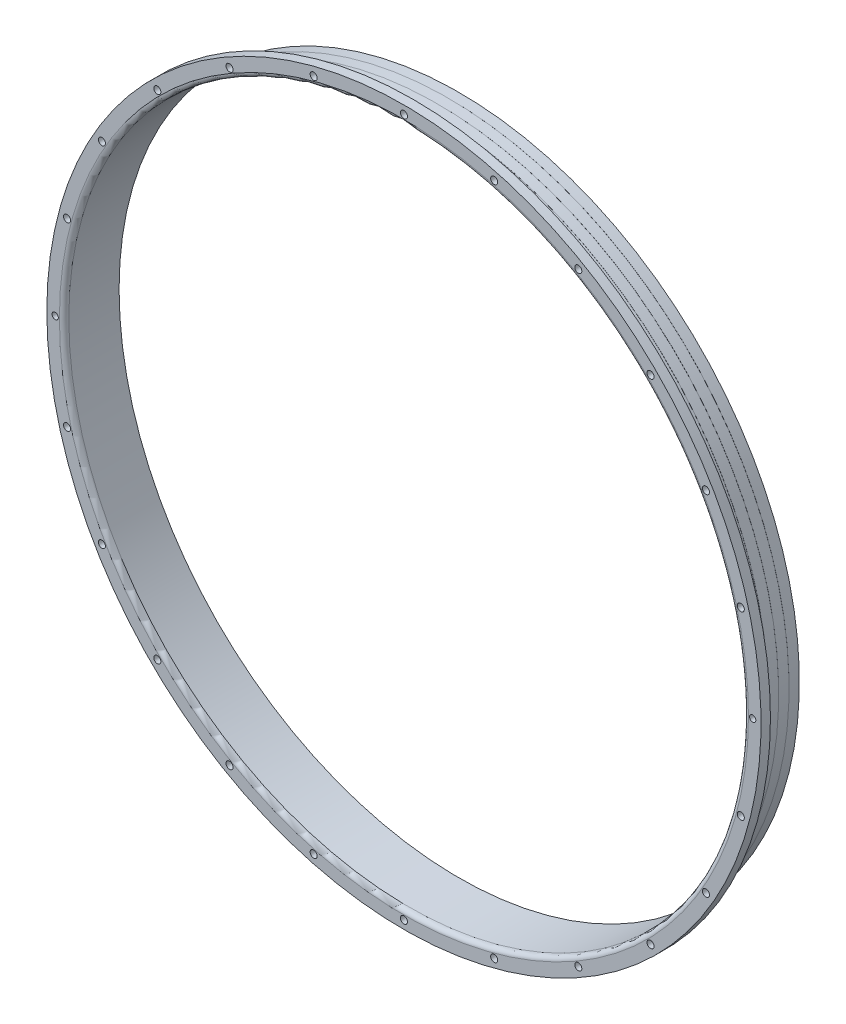
ISO-10303-21;
HEADER;
FILE_DESCRIPTION(('STEP AP214'),'2;1');
FILE_NAME('part.step','',(''),(''),'','','');
FILE_SCHEMA(('AUTOMOTIVE_DESIGN { 1 0 10303 214 1 1 1 1 }'));
ENDSEC;
DATA;
#1=APPLICATION_CONTEXT('core data for automotive mechanical design processes');
#2=APPLICATION_PROTOCOL_DEFINITION('international standard','automotive_design',2000,#1);
#3=PRODUCT_CONTEXT('',#1,'mechanical');
#4=PRODUCT('Part','Part','',(#3));
#5=PRODUCT_RELATED_PRODUCT_CATEGORY('part','',(#4));
#6=PRODUCT_DEFINITION_FORMATION('','',#4);
#7=PRODUCT_DEFINITION_CONTEXT('part definition',#1,'design');
#8=PRODUCT_DEFINITION('design','',#6,#7);
#9=PRODUCT_DEFINITION_SHAPE('','',#8);
#10=(LENGTH_UNIT() NAMED_UNIT(*) SI_UNIT(.MILLI.,.METRE.));
#11=(NAMED_UNIT(*) PLANE_ANGLE_UNIT() SI_UNIT($,.RADIAN.));
#12=(NAMED_UNIT(*) SI_UNIT($,.STERADIAN.) SOLID_ANGLE_UNIT());
#13=UNCERTAINTY_MEASURE_WITH_UNIT(LENGTH_MEASURE(1.E-05),#10,'distance_accuracy_value','');
#14=(GEOMETRIC_REPRESENTATION_CONTEXT(3) GLOBAL_UNCERTAINTY_ASSIGNED_CONTEXT((#13)) GLOBAL_UNIT_ASSIGNED_CONTEXT((#10,
#11,#12)) REPRESENTATION_CONTEXT('',''));
#15=CARTESIAN_POINT('',(0.,0.,0.));
#16=DIRECTION('',(0.,0.,1.));
#17=DIRECTION('',(1.,0.,0.));
#18=AXIS2_PLACEMENT_3D('',#15,#16,#17);
#19=CARTESIAN_POINT('',(0.,0.,0.));
#20=DIRECTION('',(0.,0.,-1.));
#21=DIRECTION('',(-1.,0.,0.));
#22=AXIS2_PLACEMENT_3D('',#19,#20,#21);
#23=CYLINDRICAL_SURFACE('',#22,217.39);
#24=CARTESIAN_POINT('',(0.,0.,-14.59025));
#25=DIRECTION('',(0.,0.,-1.));
#26=DIRECTION('',(-1.,0.,0.));
#27=AXIS2_PLACEMENT_3D('',#24,#25,#26);
#28=CIRCLE('',#27,217.39);
#29=CARTESIAN_POINT('',(-217.39,0.,-14.59025));
#30=VERTEX_POINT('',#29);
#31=EDGE_CURVE('E184',#30,#30,#28,.T.);
#32=ORIENTED_EDGE('',*,*,#31,.F.);
#33=EDGE_LOOP('',(#32));
#34=FACE_BOUND('',#33,.T.);
#35=CARTESIAN_POINT('',(0.,0.,-8.));
#36=DIRECTION('',(0.,0.,1.));
#37=DIRECTION('',(1.,0.,0.));
#38=AXIS2_PLACEMENT_3D('',#35,#36,#37);
#39=CIRCLE('',#38,217.39);
#40=CARTESIAN_POINT('',(217.39,0.,-8.));
#41=VERTEX_POINT('',#40);
#42=EDGE_CURVE('E42',#41,#41,#39,.F.);
#43=ORIENTED_EDGE('',*,*,#42,.T.);
#44=EDGE_LOOP('',(#43));
#45=FACE_BOUND('',#44,.T.);
#46=ADVANCED_FACE('F34',(#34,#45),#23,.T.);
#47=CARTESIAN_POINT('',(0.,0.,0.));
#48=DIRECTION('',(0.,0.,-1.));
#49=DIRECTION('',(-1.,0.,0.));
#50=AXIS2_PLACEMENT_3D('',#47,#48,#49);
#51=CYLINDRICAL_SURFACE('',#50,227.325);
#52=CARTESIAN_POINT('',(0.,0.,0.));
#53=DIRECTION('',(0.,0.,-1.));
#54=DIRECTION('',(-1.,0.,0.));
#55=AXIS2_PLACEMENT_3D('',#52,#53,#54);
#56=CIRCLE('',#55,227.325);
#57=CARTESIAN_POINT('',(-227.325,0.,0.));
#58=VERTEX_POINT('',#57);
#59=EDGE_CURVE('E208',#58,#58,#56,.T.);
#60=ORIENTED_EDGE('',*,*,#59,.T.);
#61=EDGE_LOOP('',(#60));
#62=FACE_BOUND('',#61,.T.);
#63=CARTESIAN_POINT('',(0.,0.,-6.));
#64=DIRECTION('',(0.,0.,1.));
#65=DIRECTION('',(1.,0.,0.));
#66=AXIS2_PLACEMENT_3D('',#63,#64,#65);
#67=CIRCLE('',#66,227.325);
#68=CARTESIAN_POINT('',(227.325,0.,-6.));
#69=VERTEX_POINT('',#68);
#70=EDGE_CURVE('E205',#69,#69,#67,.T.);
#71=ORIENTED_EDGE('',*,*,#70,.T.);
#72=EDGE_LOOP('',(#71));
#73=FACE_BOUND('',#72,.T.);
#74=ADVANCED_FACE('F223',(#62,#73),#51,.T.);
#75=CARTESIAN_POINT('',(0.,216.325,-35.));
#76=DIRECTION('',(0.,0.,-1.));
#77=DIRECTION('',(-1.,0.,0.));
#78=AXIS2_PLACEMENT_3D('',#75,#76,#77);
#79=PLANE('',#78);
#80=CARTESIAN_POINT('',(0.,0.,-35.));
#81=DIRECTION('',(0.,0.,-1.));
#82=DIRECTION('',(-1.,0.,0.));
#83=AXIS2_PLACEMENT_3D('',#80,#81,#82);
#84=CIRCLE('',#83,216.751);
#85=CARTESIAN_POINT('',(-216.751,0.,-35.));
#86=VERTEX_POINT('',#85);
#87=EDGE_CURVE('E202',#86,#86,#84,.T.);
#88=ORIENTED_EDGE('',*,*,#87,.T.);
#89=EDGE_LOOP('',(#88));
#90=FACE_BOUND('',#89,.T.);
#91=CARTESIAN_POINT('',(0.,0.,-35.));
#92=DIRECTION('',(0.,0.,-1.));
#93=DIRECTION('',(-1.,0.,0.));
#94=AXIS2_PLACEMENT_3D('',#91,#92,#93);
#95=CIRCLE('',#94,216.325);
#96=CARTESIAN_POINT('',(-216.325,0.,-35.));
#97=VERTEX_POINT('',#96);
#98=EDGE_CURVE('E47',#97,#97,#95,.T.);
#99=ORIENTED_EDGE('',*,*,#98,.F.);
#100=EDGE_LOOP('',(#99));
#101=FACE_BOUND('',#100,.T.);
#102=ADVANCED_FACE('F221',(#90,#101),#79,.T.);
#103=CARTESIAN_POINT('',(0.,0.,0.));
#104=DIRECTION('',(0.,0.,-1.));
#105=DIRECTION('',(-1.,0.,0.));
#106=AXIS2_PLACEMENT_3D('',#103,#104,#105);
#107=CYLINDRICAL_SURFACE('',#106,216.325);
#108=CARTESIAN_POINT('',(0.,0.,-3.));
#109=DIRECTION('',(0.,0.,-1.));
#110=DIRECTION('',(-1.,0.,0.));
#111=AXIS2_PLACEMENT_3D('',#108,#109,#110);
#112=CIRCLE('',#111,216.325);
#113=CARTESIAN_POINT('',(-216.325,0.,-3.));
#114=VERTEX_POINT('',#113);
#115=EDGE_CURVE('E214',#114,#114,#112,.T.);
#116=ORIENTED_EDGE('',*,*,#115,.F.);
#117=EDGE_LOOP('',(#116));
#118=FACE_BOUND('',#117,.T.);
#119=ORIENTED_EDGE('',*,*,#98,.T.);
#120=EDGE_LOOP('',(#119));
#121=FACE_BOUND('',#120,.T.);
#122=ADVANCED_FACE('F219',(#118,#121),#107,.F.);
#123=CARTESIAN_POINT('',(0.,0.,-3.));
#124=DIRECTION('',(0.,0.,-1.));
#125=DIRECTION('',(-1.,0.,0.));
#126=AXIS2_PLACEMENT_3D('',#123,#124,#125);
#127=TOROIDAL_SURFACE('',#126,219.325,3.);
#128=ORIENTED_EDGE('',*,*,#115,.T.);
#129=EDGE_LOOP('',(#128));
#130=FACE_BOUND('',#129,.T.);
#131=CARTESIAN_POINT('',(0.,0.,0.));
#132=DIRECTION('',(0.,0.,-1.));
#133=DIRECTION('',(-1.,0.,0.));
#134=AXIS2_PLACEMENT_3D('',#131,#132,#133);
#135=CIRCLE('',#134,219.325);
#136=CARTESIAN_POINT('',(-219.325,0.,0.));
#137=VERTEX_POINT('',#136);
#138=EDGE_CURVE('E211',#137,#137,#135,.T.);
#139=ORIENTED_EDGE('',*,*,#138,.F.);
#140=EDGE_LOOP('',(#139));
#141=FACE_BOUND('',#140,.T.);
#142=ADVANCED_FACE('F230',(#130,#141),#127,.T.);
#143=CARTESIAN_POINT('',(0.,227.325,0.));
#144=DIRECTION('',(0.,0.,1.));
#145=DIRECTION('',(1.,0.,0.));
#146=AXIS2_PLACEMENT_3D('',#143,#144,#145);
#147=PLANE('',#146);
#148=CARTESIAN_POINT('',(57.4578280127567,214.435533436174,0.));
#149=DIRECTION('',(0.,0.,1.));
#150=DIRECTION('',(1.,0.,0.));
#151=AXIS2_PLACEMENT_3D('',#148,#149,#150);
#152=CIRCLE('',#151,2.25);
#153=CARTESIAN_POINT('',(59.7078280127567,214.435533436174,0.));
#154=VERTEX_POINT('',#153);
#155=EDGE_CURVE('E106',#154,#154,#152,.T.);
#156=ORIENTED_EDGE('',*,*,#155,.F.);
#157=EDGE_LOOP('',(#156));
#158=FACE_BOUND('',#157,.T.);
#159=CARTESIAN_POINT('',(110.999999999998,192.257639640147,0.));
#160=DIRECTION('',(0.,0.,1.));
#161=DIRECTION('',(1.,0.,0.));
#162=AXIS2_PLACEMENT_3D('',#159,#160,#161);
#163=CIRCLE('',#162,2.25);
#164=CARTESIAN_POINT('',(113.249999999998,192.257639640147,0.));
#165=VERTEX_POINT('',#164);
#166=EDGE_CURVE('E96',#165,#165,#163,.T.);
#167=ORIENTED_EDGE('',*,*,#166,.F.);
#168=EDGE_LOOP('',(#167));
#169=FACE_BOUND('',#168,.T.);
#170=CARTESIAN_POINT('',(156.977705423412,156.977705423415,0.));
#171=DIRECTION('',(0.,0.,1.));
#172=DIRECTION('',(1.,0.,0.));
#173=AXIS2_PLACEMENT_3D('',#170,#171,#172);
#174=CIRCLE('',#173,2.25);
#175=CARTESIAN_POINT('',(159.227705423412,156.977705423415,0.));
#176=VERTEX_POINT('',#175);
#177=EDGE_CURVE('E93',#176,#176,#174,.T.);
#178=ORIENTED_EDGE('',*,*,#177,.F.);
#179=EDGE_LOOP('',(#178));
#180=FACE_BOUND('',#179,.T.);
#181=CARTESIAN_POINT('',(192.257639640144,111.000000000002,0.));
#182=DIRECTION('',(0.,0.,1.));
#183=DIRECTION('',(1.,0.,0.));
#184=AXIS2_PLACEMENT_3D('',#181,#182,#183);
#185=CIRCLE('',#184,2.25);
#186=CARTESIAN_POINT('',(194.507639640144,111.000000000002,0.));
#187=VERTEX_POINT('',#186);
#188=EDGE_CURVE('E90',#187,#187,#185,.T.);
#189=ORIENTED_EDGE('',*,*,#188,.F.);
#190=EDGE_LOOP('',(#189));
#191=FACE_BOUND('',#190,.T.);
#192=CARTESIAN_POINT('',(214.435533436173,57.457828012762,0.));
#193=DIRECTION('',(0.,0.,1.));
#194=DIRECTION('',(1.,0.,0.));
#195=AXIS2_PLACEMENT_3D('',#192,#193,#194);
#196=CIRCLE('',#195,2.25);
#197=CARTESIAN_POINT('',(216.685533436173,57.457828012762,0.));
#198=VERTEX_POINT('',#197);
#199=EDGE_CURVE('E86',#198,#198,#196,.T.);
#200=ORIENTED_EDGE('',*,*,#199,.F.);
#201=EDGE_LOOP('',(#200));
#202=FACE_BOUND('',#201,.T.);
#203=CARTESIAN_POINT('',(214.435533436174,-57.4578280127575,0.));
#204=DIRECTION('',(0.,0.,1.));
#205=DIRECTION('',(1.,0.,0.));
#206=AXIS2_PLACEMENT_3D('',#203,#204,#205);
#207=CIRCLE('',#206,2.25);
#208=CARTESIAN_POINT('',(216.685533436174,-57.4578280127575,0.));
#209=VERTEX_POINT('',#208);
#210=EDGE_CURVE('E82',#209,#209,#207,.T.);
#211=ORIENTED_EDGE('',*,*,#210,.F.);
#212=EDGE_LOOP('',(#211));
#213=FACE_BOUND('',#212,.T.);
#214=CARTESIAN_POINT('',(192.257639640146,-110.999999999998,0.));
#215=DIRECTION('',(0.,0.,1.));
#216=DIRECTION('',(1.,0.,0.));
#217=AXIS2_PLACEMENT_3D('',#214,#215,#216);
#218=CIRCLE('',#217,2.25);
#219=CARTESIAN_POINT('',(194.507639640146,-110.999999999998,0.));
#220=VERTEX_POINT('',#219);
#221=EDGE_CURVE('E81',#220,#220,#218,.T.);
#222=ORIENTED_EDGE('',*,*,#221,.F.);
#223=EDGE_LOOP('',(#222));
#224=FACE_BOUND('',#223,.T.);
#225=CARTESIAN_POINT('',(156.977705423415,-156.977705423412,0.));
#226=DIRECTION('',(0.,0.,1.));
#227=DIRECTION('',(1.,0.,0.));
#228=AXIS2_PLACEMENT_3D('',#225,#226,#227);
#229=CIRCLE('',#228,2.25);
#230=CARTESIAN_POINT('',(159.227705423415,-156.977705423412,0.));
#231=VERTEX_POINT('',#230);
#232=EDGE_CURVE('E121',#231,#231,#229,.T.);
#233=ORIENTED_EDGE('',*,*,#232,.F.);
#234=EDGE_LOOP('',(#233));
#235=FACE_BOUND('',#234,.T.);
#236=CARTESIAN_POINT('',(111.000000000002,-192.257639640144,0.));
#237=DIRECTION('',(0.,0.,1.));
#238=DIRECTION('',(1.,0.,0.));
#239=AXIS2_PLACEMENT_3D('',#236,#237,#238);
#240=CIRCLE('',#239,2.25);
#241=CARTESIAN_POINT('',(113.250000000002,-192.257639640144,0.));
#242=VERTEX_POINT('',#241);
#243=EDGE_CURVE('E127',#242,#242,#240,.T.);
#244=ORIENTED_EDGE('',*,*,#243,.F.);
#245=EDGE_LOOP('',(#244));
#246=FACE_BOUND('',#245,.T.);
#247=CARTESIAN_POINT('',(57.4578280127612,-214.435533436173,0.));
#248=DIRECTION('',(0.,0.,1.));
#249=DIRECTION('',(1.,0.,0.));
#250=AXIS2_PLACEMENT_3D('',#247,#248,#249);
#251=CIRCLE('',#250,2.25);
#252=CARTESIAN_POINT('',(59.7078280127612,-214.435533436173,0.));
#253=VERTEX_POINT('',#252);
#254=EDGE_CURVE('E77',#253,#253,#251,.T.);
#255=ORIENTED_EDGE('',*,*,#254,.F.);
#256=EDGE_LOOP('',(#255));
#257=FACE_BOUND('',#256,.T.);
#258=CARTESIAN_POINT('',(0.,-222.,0.));
#259=DIRECTION('',(0.,0.,1.));
#260=DIRECTION('',(1.,0.,0.));
#261=AXIS2_PLACEMENT_3D('',#258,#259,#260);
#262=CIRCLE('',#261,2.25);
#263=CARTESIAN_POINT('',(2.25,-222.,0.));
#264=VERTEX_POINT('',#263);
#265=EDGE_CURVE('E76',#264,#264,#262,.T.);
#266=ORIENTED_EDGE('',*,*,#265,.F.);
#267=EDGE_LOOP('',(#266));
#268=FACE_BOUND('',#267,.T.);
#269=CARTESIAN_POINT('',(-57.4578280127582,-214.435533436174,0.));
#270=DIRECTION('',(0.,0.,1.));
#271=DIRECTION('',(1.,0.,0.));
#272=AXIS2_PLACEMENT_3D('',#269,#270,#271);
#273=CIRCLE('',#272,2.25);
#274=CARTESIAN_POINT('',(-55.2078280127582,-214.435533436174,0.));
#275=VERTEX_POINT('',#274);
#276=EDGE_CURVE('E140',#275,#275,#273,.T.);
#277=ORIENTED_EDGE('',*,*,#276,.F.);
#278=EDGE_LOOP('',(#277));
#279=FACE_BOUND('',#278,.T.);
#280=CARTESIAN_POINT('',(-110.999999999999,-192.257639640146,0.));
#281=DIRECTION('',(0.,0.,1.));
#282=DIRECTION('',(1.,0.,0.));
#283=AXIS2_PLACEMENT_3D('',#280,#281,#282);
#284=CIRCLE('',#283,2.25);
#285=CARTESIAN_POINT('',(-108.749999999999,-192.257639640146,0.));
#286=VERTEX_POINT('',#285);
#287=EDGE_CURVE('E146',#286,#286,#284,.T.);
#288=ORIENTED_EDGE('',*,*,#287,.F.);
#289=EDGE_LOOP('',(#288));
#290=FACE_BOUND('',#289,.T.);
#291=CARTESIAN_POINT('',(-156.977705423413,-156.977705423414,0.));
#292=DIRECTION('',(0.,0.,1.));
#293=DIRECTION('',(1.,0.,0.));
#294=AXIS2_PLACEMENT_3D('',#291,#292,#293);
#295=CIRCLE('',#294,2.25);
#296=CARTESIAN_POINT('',(-154.727705423413,-156.977705423414,0.));
#297=VERTEX_POINT('',#296);
#298=EDGE_CURVE('E152',#297,#297,#295,.T.);
#299=ORIENTED_EDGE('',*,*,#298,.F.);
#300=EDGE_LOOP('',(#299));
#301=FACE_BOUND('',#300,.T.);
#302=CARTESIAN_POINT('',(-192.257639640145,-111.000000000001,0.));
#303=DIRECTION('',(0.,0.,1.));
#304=DIRECTION('',(1.,0.,0.));
#305=AXIS2_PLACEMENT_3D('',#302,#303,#304);
#306=CIRCLE('',#305,2.25);
#307=CARTESIAN_POINT('',(-190.007639640145,-111.000000000001,0.));
#308=VERTEX_POINT('',#307);
#309=EDGE_CURVE('E158',#308,#308,#306,.T.);
#310=ORIENTED_EDGE('',*,*,#309,.F.);
#311=EDGE_LOOP('',(#310));
#312=FACE_BOUND('',#311,.T.);
#313=CARTESIAN_POINT('',(-214.435533436173,-57.4578280127605,0.));
#314=DIRECTION('',(0.,0.,1.));
#315=DIRECTION('',(1.,0.,0.));
#316=AXIS2_PLACEMENT_3D('',#313,#314,#315);
#317=CIRCLE('',#316,2.25);
#318=CARTESIAN_POINT('',(-212.185533436173,-57.4578280127605,0.));
#319=VERTEX_POINT('',#318);
#320=EDGE_CURVE('E72',#319,#319,#317,.T.);
#321=ORIENTED_EDGE('',*,*,#320,.F.);
#322=EDGE_LOOP('',(#321));
#323=FACE_BOUND('',#322,.T.);
#324=CARTESIAN_POINT('',(-214.435533436173,57.457828012759,0.));
#325=DIRECTION('',(0.,0.,1.));
#326=DIRECTION('',(1.,0.,0.));
#327=AXIS2_PLACEMENT_3D('',#324,#325,#326);
#328=CIRCLE('',#327,2.25);
#329=CARTESIAN_POINT('',(-212.185533436173,57.457828012759,0.));
#330=VERTEX_POINT('',#329);
#331=EDGE_CURVE('E68',#330,#330,#328,.T.);
#332=ORIENTED_EDGE('',*,*,#331,.F.);
#333=EDGE_LOOP('',(#332));
#334=FACE_BOUND('',#333,.T.);
#335=CARTESIAN_POINT('',(-192.257639640146,111.,0.));
#336=DIRECTION('',(0.,0.,1.));
#337=DIRECTION('',(1.,0.,0.));
#338=AXIS2_PLACEMENT_3D('',#335,#336,#337);
#339=CIRCLE('',#338,2.25);
#340=CARTESIAN_POINT('',(-190.007639640146,111.,0.));
#341=VERTEX_POINT('',#340);
#342=EDGE_CURVE('E64',#341,#341,#339,.T.);
#343=ORIENTED_EDGE('',*,*,#342,.F.);
#344=EDGE_LOOP('',(#343));
#345=FACE_BOUND('',#344,.T.);
#346=CARTESIAN_POINT('',(-156.977705423414,156.977705423413,0.));
#347=DIRECTION('',(0.,0.,1.));
#348=DIRECTION('',(1.,0.,0.));
#349=AXIS2_PLACEMENT_3D('',#346,#347,#348);
#350=CIRCLE('',#349,2.25);
#351=CARTESIAN_POINT('',(-154.727705423414,156.977705423413,0.));
#352=VERTEX_POINT('',#351);
#353=EDGE_CURVE('E60',#352,#352,#350,.T.);
#354=ORIENTED_EDGE('',*,*,#353,.F.);
#355=EDGE_LOOP('',(#354));
#356=FACE_BOUND('',#355,.T.);
#357=CARTESIAN_POINT('',(-111.,192.257639640145,0.));
#358=DIRECTION('',(0.,0.,1.));
#359=DIRECTION('',(1.,0.,0.));
#360=AXIS2_PLACEMENT_3D('',#357,#358,#359);
#361=CIRCLE('',#360,2.25);
#362=CARTESIAN_POINT('',(-108.75,192.257639640145,0.));
#363=VERTEX_POINT('',#362);
#364=EDGE_CURVE('E59',#363,#363,#361,.T.);
#365=ORIENTED_EDGE('',*,*,#364,.F.);
#366=EDGE_LOOP('',(#365));
#367=FACE_BOUND('',#366,.T.);
#368=CARTESIAN_POINT('',(-57.4578280127597,214.435533436173,0.));
#369=DIRECTION('',(0.,0.,1.));
#370=DIRECTION('',(1.,0.,0.));
#371=AXIS2_PLACEMENT_3D('',#368,#369,#370);
#372=CIRCLE('',#371,2.25);
#373=CARTESIAN_POINT('',(-55.2078280127597,214.435533436173,0.));
#374=VERTEX_POINT('',#373);
#375=EDGE_CURVE('E55',#374,#374,#372,.T.);
#376=ORIENTED_EDGE('',*,*,#375,.F.);
#377=EDGE_LOOP('',(#376));
#378=FACE_BOUND('',#377,.T.);
#379=CARTESIAN_POINT('',(0.,222.,0.));
#380=DIRECTION('',(0.,0.,1.));
#381=DIRECTION('',(1.,0.,0.));
#382=AXIS2_PLACEMENT_3D('',#379,#380,#381);
#383=CIRCLE('',#382,2.25);
#384=CARTESIAN_POINT('',(2.25,222.,0.));
#385=VERTEX_POINT('',#384);
#386=EDGE_CURVE('E54',#385,#385,#383,.T.);
#387=ORIENTED_EDGE('',*,*,#386,.F.);
#388=EDGE_LOOP('',(#387));
#389=FACE_BOUND('',#388,.T.);
#390=ORIENTED_EDGE('',*,*,#138,.T.);
#391=EDGE_LOOP('',(#390));
#392=FACE_BOUND('',#391,.T.);
#393=ORIENTED_EDGE('',*,*,#59,.F.);
#394=EDGE_LOOP('',(#393));
#395=FACE_BOUND('',#394,.T.);
#396=CARTESIAN_POINT('',(-222.,-7.74891763399207E-13,0.));
#397=DIRECTION('',(0.,0.,1.));
#398=DIRECTION('',(1.,0.,0.));
#399=AXIS2_PLACEMENT_3D('',#396,#397,#398);
#400=CIRCLE('',#399,2.);
#401=CARTESIAN_POINT('',(-220.,-7.74891763399207E-13,0.));
#402=VERTEX_POINT('',#401);
#403=EDGE_CURVE('E278',#402,#402,#400,.T.);
#404=ORIENTED_EDGE('',*,*,#403,.F.);
#405=EDGE_LOOP('',(#404));
#406=FACE_BOUND('',#405,.T.);
#407=CARTESIAN_POINT('',(222.,2.32510947784556E-12,0.));
#408=DIRECTION('',(0.,0.,1.));
#409=DIRECTION('',(1.,0.,0.));
#410=AXIS2_PLACEMENT_3D('',#407,#408,#409);
#411=CIRCLE('',#410,2.);
#412=CARTESIAN_POINT('',(224.,2.32510947784556E-12,0.));
#413=VERTEX_POINT('',#412);
#414=EDGE_CURVE('E281',#413,#413,#411,.T.);
#415=ORIENTED_EDGE('',*,*,#414,.F.);
#416=EDGE_LOOP('',(#415));
#417=FACE_BOUND('',#416,.T.);
#418=ADVANCED_FACE('F254',(#158,#169,#180,#191,#202,#213,#224,#235,#246,#257,#268,#279,#290,
#301,#312,#323,#334,#345,#356,#367,#378,#389,#392,#395,#406,#417),#147,.T.);
#419=CARTESIAN_POINT('',(0.,227.325,-6.));
#420=DIRECTION('',(0.,0.,1.));
#421=DIRECTION('',(1.,0.,0.));
#422=AXIS2_PLACEMENT_3D('',#419,#420,#421);
#423=PLANE('',#422);
#424=CARTESIAN_POINT('',(57.4578280127567,214.435533436174,-6.));
#425=DIRECTION('',(0.,0.,1.));
#426=DIRECTION('',(1.,0.,0.));
#427=AXIS2_PLACEMENT_3D('',#424,#425,#426);
#428=CIRCLE('',#427,2.25);
#429=CARTESIAN_POINT('',(59.7078280127567,214.435533436174,-6.));
#430=VERTEX_POINT('',#429);
#431=EDGE_CURVE('E38',#430,#430,#428,.T.);
#432=ORIENTED_EDGE('',*,*,#431,.T.);
#433=EDGE_LOOP('',(#432));
#434=FACE_BOUND('',#433,.T.);
#435=CARTESIAN_POINT('',(110.999999999998,192.257639640147,-6.));
#436=DIRECTION('',(0.,0.,1.));
#437=DIRECTION('',(1.,0.,0.));
#438=AXIS2_PLACEMENT_3D('',#435,#436,#437);
#439=CIRCLE('',#438,2.25);
#440=CARTESIAN_POINT('',(113.249999999998,192.257639640147,-6.));
#441=VERTEX_POINT('',#440);
#442=EDGE_CURVE('E94',#441,#441,#439,.T.);
#443=ORIENTED_EDGE('',*,*,#442,.T.);
#444=EDGE_LOOP('',(#443));
#445=FACE_BOUND('',#444,.T.);
#446=CARTESIAN_POINT('',(156.977705423412,156.977705423415,-6.));
#447=DIRECTION('',(0.,0.,1.));
#448=DIRECTION('',(1.,0.,0.));
#449=AXIS2_PLACEMENT_3D('',#446,#447,#448);
#450=CIRCLE('',#449,2.25);
#451=CARTESIAN_POINT('',(159.227705423412,156.977705423415,-6.));
#452=VERTEX_POINT('',#451);
#453=EDGE_CURVE('E91',#452,#452,#450,.T.);
#454=ORIENTED_EDGE('',*,*,#453,.T.);
#455=EDGE_LOOP('',(#454));
#456=FACE_BOUND('',#455,.T.);
#457=CARTESIAN_POINT('',(192.257639640144,111.000000000002,-6.));
#458=DIRECTION('',(0.,0.,1.));
#459=DIRECTION('',(1.,0.,0.));
#460=AXIS2_PLACEMENT_3D('',#457,#458,#459);
#461=CIRCLE('',#460,2.25);
#462=CARTESIAN_POINT('',(194.507639640144,111.000000000002,-6.));
#463=VERTEX_POINT('',#462);
#464=EDGE_CURVE('E87',#463,#463,#461,.T.);
#465=ORIENTED_EDGE('',*,*,#464,.T.);
#466=EDGE_LOOP('',(#465));
#467=FACE_BOUND('',#466,.T.);
#468=CARTESIAN_POINT('',(214.435533436173,57.457828012762,-6.));
#469=DIRECTION('',(0.,0.,1.));
#470=DIRECTION('',(1.,0.,0.));
#471=AXIS2_PLACEMENT_3D('',#468,#469,#470);
#472=CIRCLE('',#471,2.25);
#473=CARTESIAN_POINT('',(216.685533436173,57.457828012762,-6.));
#474=VERTEX_POINT('',#473);
#475=EDGE_CURVE('E83',#474,#474,#472,.T.);
#476=ORIENTED_EDGE('',*,*,#475,.T.);
#477=EDGE_LOOP('',(#476));
#478=FACE_BOUND('',#477,.T.);
#479=CARTESIAN_POINT('',(214.435533436174,-57.4578280127575,-6.));
#480=DIRECTION('',(0.,0.,1.));
#481=DIRECTION('',(1.,0.,0.));
#482=AXIS2_PLACEMENT_3D('',#479,#480,#481);
#483=CIRCLE('',#482,2.25);
#484=CARTESIAN_POINT('',(216.685533436174,-57.4578280127575,-6.));
#485=VERTEX_POINT('',#484);
#486=EDGE_CURVE('E78',#485,#485,#483,.T.);
#487=ORIENTED_EDGE('',*,*,#486,.T.);
#488=EDGE_LOOP('',(#487));
#489=FACE_BOUND('',#488,.T.);
#490=CARTESIAN_POINT('',(192.257639640146,-110.999999999998,-6.));
#491=DIRECTION('',(0.,0.,1.));
#492=DIRECTION('',(1.,0.,0.));
#493=AXIS2_PLACEMENT_3D('',#490,#491,#492);
#494=CIRCLE('',#493,2.25);
#495=CARTESIAN_POINT('',(194.507639640146,-110.999999999998,-6.));
#496=VERTEX_POINT('',#495);
#497=EDGE_CURVE('E118',#496,#496,#494,.T.);
#498=ORIENTED_EDGE('',*,*,#497,.T.);
#499=EDGE_LOOP('',(#498));
#500=FACE_BOUND('',#499,.T.);
#501=CARTESIAN_POINT('',(156.977705423415,-156.977705423412,-6.));
#502=DIRECTION('',(0.,0.,1.));
#503=DIRECTION('',(1.,0.,0.));
#504=AXIS2_PLACEMENT_3D('',#501,#502,#503);
#505=CIRCLE('',#504,2.25);
#506=CARTESIAN_POINT('',(159.227705423415,-156.977705423412,-6.));
#507=VERTEX_POINT('',#506);
#508=EDGE_CURVE('E124',#507,#507,#505,.T.);
#509=ORIENTED_EDGE('',*,*,#508,.T.);
#510=EDGE_LOOP('',(#509));
#511=FACE_BOUND('',#510,.T.);
#512=CARTESIAN_POINT('',(111.000000000002,-192.257639640144,-6.));
#513=DIRECTION('',(0.,0.,1.));
#514=DIRECTION('',(1.,0.,0.));
#515=AXIS2_PLACEMENT_3D('',#512,#513,#514);
#516=CIRCLE('',#515,2.25);
#517=CARTESIAN_POINT('',(113.250000000002,-192.257639640144,-6.));
#518=VERTEX_POINT('',#517);
#519=EDGE_CURVE('E130',#518,#518,#516,.T.);
#520=ORIENTED_EDGE('',*,*,#519,.T.);
#521=EDGE_LOOP('',(#520));
#522=FACE_BOUND('',#521,.T.);
#523=CARTESIAN_POINT('',(57.4578280127612,-214.435533436173,-6.));
#524=DIRECTION('',(0.,0.,1.));
#525=DIRECTION('',(1.,0.,0.));
#526=AXIS2_PLACEMENT_3D('',#523,#524,#525);
#527=CIRCLE('',#526,2.25);
#528=CARTESIAN_POINT('',(59.7078280127612,-214.435533436173,-6.));
#529=VERTEX_POINT('',#528);
#530=EDGE_CURVE('E73',#529,#529,#527,.T.);
#531=ORIENTED_EDGE('',*,*,#530,.T.);
#532=EDGE_LOOP('',(#531));
#533=FACE_BOUND('',#532,.T.);
#534=CARTESIAN_POINT('',(0.,-222.,-6.));
#535=DIRECTION('',(0.,0.,1.));
#536=DIRECTION('',(1.,0.,0.));
#537=AXIS2_PLACEMENT_3D('',#534,#535,#536);
#538=CIRCLE('',#537,2.25);
#539=CARTESIAN_POINT('',(2.25,-222.,-6.));
#540=VERTEX_POINT('',#539);
#541=EDGE_CURVE('E137',#540,#540,#538,.T.);
#542=ORIENTED_EDGE('',*,*,#541,.T.);
#543=EDGE_LOOP('',(#542));
#544=FACE_BOUND('',#543,.T.);
#545=CARTESIAN_POINT('',(-57.4578280127582,-214.435533436174,-6.));
#546=DIRECTION('',(0.,0.,1.));
#547=DIRECTION('',(1.,0.,0.));
#548=AXIS2_PLACEMENT_3D('',#545,#546,#547);
#549=CIRCLE('',#548,2.25);
#550=CARTESIAN_POINT('',(-55.2078280127582,-214.435533436174,-6.));
#551=VERTEX_POINT('',#550);
#552=EDGE_CURVE('E143',#551,#551,#549,.T.);
#553=ORIENTED_EDGE('',*,*,#552,.T.);
#554=EDGE_LOOP('',(#553));
#555=FACE_BOUND('',#554,.T.);
#556=CARTESIAN_POINT('',(-110.999999999999,-192.257639640146,-6.));
#557=DIRECTION('',(0.,0.,1.));
#558=DIRECTION('',(1.,0.,0.));
#559=AXIS2_PLACEMENT_3D('',#556,#557,#558);
#560=CIRCLE('',#559,2.25);
#561=CARTESIAN_POINT('',(-108.749999999999,-192.257639640146,-6.));
#562=VERTEX_POINT('',#561);
#563=EDGE_CURVE('E149',#562,#562,#560,.T.);
#564=ORIENTED_EDGE('',*,*,#563,.T.);
#565=EDGE_LOOP('',(#564));
#566=FACE_BOUND('',#565,.T.);
#567=CARTESIAN_POINT('',(-156.977705423413,-156.977705423414,-6.));
#568=DIRECTION('',(0.,0.,1.));
#569=DIRECTION('',(1.,0.,0.));
#570=AXIS2_PLACEMENT_3D('',#567,#568,#569);
#571=CIRCLE('',#570,2.25);
#572=CARTESIAN_POINT('',(-154.727705423413,-156.977705423414,-6.));
#573=VERTEX_POINT('',#572);
#574=EDGE_CURVE('E155',#573,#573,#571,.T.);
#575=ORIENTED_EDGE('',*,*,#574,.T.);
#576=EDGE_LOOP('',(#575));
#577=FACE_BOUND('',#576,.T.);
#578=CARTESIAN_POINT('',(-192.257639640145,-111.000000000001,-6.));
#579=DIRECTION('',(0.,0.,1.));
#580=DIRECTION('',(1.,0.,0.));
#581=AXIS2_PLACEMENT_3D('',#578,#579,#580);
#582=CIRCLE('',#581,2.25);
#583=CARTESIAN_POINT('',(-190.007639640145,-111.000000000001,-6.));
#584=VERTEX_POINT('',#583);
#585=EDGE_CURVE('E161',#584,#584,#582,.T.);
#586=ORIENTED_EDGE('',*,*,#585,.T.);
#587=EDGE_LOOP('',(#586));
#588=FACE_BOUND('',#587,.T.);
#589=CARTESIAN_POINT('',(-214.435533436173,-57.4578280127605,-6.));
#590=DIRECTION('',(0.,0.,1.));
#591=DIRECTION('',(1.,0.,0.));
#592=AXIS2_PLACEMENT_3D('',#589,#590,#591);
#593=CIRCLE('',#592,2.25);
#594=CARTESIAN_POINT('',(-212.185533436173,-57.4578280127605,-6.));
#595=VERTEX_POINT('',#594);
#596=EDGE_CURVE('E69',#595,#595,#593,.T.);
#597=ORIENTED_EDGE('',*,*,#596,.T.);
#598=EDGE_LOOP('',(#597));
#599=FACE_BOUND('',#598,.T.);
#600=CARTESIAN_POINT('',(-214.435533436173,57.457828012759,-6.));
#601=DIRECTION('',(0.,0.,1.));
#602=DIRECTION('',(1.,0.,0.));
#603=AXIS2_PLACEMENT_3D('',#600,#601,#602);
#604=CIRCLE('',#603,2.25);
#605=CARTESIAN_POINT('',(-212.185533436173,57.457828012759,-6.));
#606=VERTEX_POINT('',#605);
#607=EDGE_CURVE('E65',#606,#606,#604,.T.);
#608=ORIENTED_EDGE('',*,*,#607,.T.);
#609=EDGE_LOOP('',(#608));
#610=FACE_BOUND('',#609,.T.);
#611=CARTESIAN_POINT('',(-192.257639640146,111.,-6.));
#612=DIRECTION('',(0.,0.,1.));
#613=DIRECTION('',(1.,0.,0.));
#614=AXIS2_PLACEMENT_3D('',#611,#612,#613);
#615=CIRCLE('',#614,2.25);
#616=CARTESIAN_POINT('',(-190.007639640146,111.,-6.));
#617=VERTEX_POINT('',#616);
#618=EDGE_CURVE('E61',#617,#617,#615,.T.);
#619=ORIENTED_EDGE('',*,*,#618,.T.);
#620=EDGE_LOOP('',(#619));
#621=FACE_BOUND('',#620,.T.);
#622=CARTESIAN_POINT('',(-156.977705423414,156.977705423413,-6.));
#623=DIRECTION('',(0.,0.,1.));
#624=DIRECTION('',(1.,0.,0.));
#625=AXIS2_PLACEMENT_3D('',#622,#623,#624);
#626=CIRCLE('',#625,2.25);
#627=CARTESIAN_POINT('',(-154.727705423414,156.977705423413,-6.));
#628=VERTEX_POINT('',#627);
#629=EDGE_CURVE('E56',#628,#628,#626,.T.);
#630=ORIENTED_EDGE('',*,*,#629,.T.);
#631=EDGE_LOOP('',(#630));
#632=FACE_BOUND('',#631,.T.);
#633=CARTESIAN_POINT('',(-111.,192.257639640145,-6.));
#634=DIRECTION('',(0.,0.,1.));
#635=DIRECTION('',(1.,0.,0.));
#636=AXIS2_PLACEMENT_3D('',#633,#634,#635);
#637=CIRCLE('',#636,2.25);
#638=CARTESIAN_POINT('',(-108.75,192.257639640145,-6.));
#639=VERTEX_POINT('',#638);
#640=EDGE_CURVE('E174',#639,#639,#637,.T.);
#641=ORIENTED_EDGE('',*,*,#640,.T.);
#642=EDGE_LOOP('',(#641));
#643=FACE_BOUND('',#642,.T.);
#644=CARTESIAN_POINT('',(-57.4578280127597,214.435533436173,-6.));
#645=DIRECTION('',(0.,0.,1.));
#646=DIRECTION('',(1.,0.,0.));
#647=AXIS2_PLACEMENT_3D('',#644,#645,#646);
#648=CIRCLE('',#647,2.25);
#649=CARTESIAN_POINT('',(-55.2078280127597,214.435533436173,-6.));
#650=VERTEX_POINT('',#649);
#651=EDGE_CURVE('E51',#650,#650,#648,.T.);
#652=ORIENTED_EDGE('',*,*,#651,.T.);
#653=EDGE_LOOP('',(#652));
#654=FACE_BOUND('',#653,.T.);
#655=CARTESIAN_POINT('',(0.,222.,-6.));
#656=DIRECTION('',(0.,0.,1.));
#657=DIRECTION('',(1.,0.,0.));
#658=AXIS2_PLACEMENT_3D('',#655,#656,#657);
#659=CIRCLE('',#658,2.25);
#660=CARTESIAN_POINT('',(2.25,222.,-6.));
#661=VERTEX_POINT('',#660);
#662=EDGE_CURVE('E181',#661,#661,#659,.T.);
#663=ORIENTED_EDGE('',*,*,#662,.T.);
#664=EDGE_LOOP('',(#663));
#665=FACE_BOUND('',#664,.T.);
#666=CARTESIAN_POINT('',(0.,0.,-6.));
#667=DIRECTION('',(0.,0.,1.));
#668=DIRECTION('',(1.,0.,0.));
#669=AXIS2_PLACEMENT_3D('',#666,#667,#668);
#670=CIRCLE('',#669,219.39);
#671=CARTESIAN_POINT('',(219.39,0.,-6.));
#672=VERTEX_POINT('',#671);
#673=EDGE_CURVE('E10',#672,#672,#670,.T.);
#674=ORIENTED_EDGE('',*,*,#673,.T.);
#675=EDGE_LOOP('',(#674));
#676=FACE_BOUND('',#675,.T.);
#677=ORIENTED_EDGE('',*,*,#70,.F.);
#678=EDGE_LOOP('',(#677));
#679=FACE_BOUND('',#678,.T.);
#680=CARTESIAN_POINT('',(-222.,-7.74891763399207E-13,-6.));
#681=DIRECTION('',(0.,0.,1.));
#682=DIRECTION('',(1.,0.,0.));
#683=AXIS2_PLACEMENT_3D('',#680,#681,#682);
#684=CIRCLE('',#683,2.);
#685=CARTESIAN_POINT('',(-220.,-7.74891763399207E-13,-6.));
#686=VERTEX_POINT('',#685);
#687=EDGE_CURVE('E288',#686,#686,#684,.F.);
#688=ORIENTED_EDGE('',*,*,#687,.F.);
#689=EDGE_LOOP('',(#688));
#690=FACE_BOUND('',#689,.T.);
#691=CARTESIAN_POINT('',(222.,2.32510947784556E-12,-6.));
#692=DIRECTION('',(0.,0.,1.));
#693=DIRECTION('',(1.,0.,0.));
#694=AXIS2_PLACEMENT_3D('',#691,#692,#693);
#695=CIRCLE('',#694,2.);
#696=CARTESIAN_POINT('',(224.,2.32510947784556E-12,-6.));
#697=VERTEX_POINT('',#696);
#698=EDGE_CURVE('E283',#697,#697,#695,.F.);
#699=ORIENTED_EDGE('',*,*,#698,.F.);
#700=EDGE_LOOP('',(#699));
#701=FACE_BOUND('',#700,.T.);
#702=ADVANCED_FACE('F245',(#434,#445,#456,#467,#478,#489,#500,#511,#522,#533,#544,#555,#566,
#577,#588,#599,#610,#621,#632,#643,#654,#665,#676,#679,#690,#701),#423,.F.);
#703=CARTESIAN_POINT('',(0.,0.,-8.));
#704=DIRECTION('',(0.,0.,1.));
#705=DIRECTION('',(1.,0.,0.));
#706=AXIS2_PLACEMENT_3D('',#703,#704,#705);
#707=TOROIDAL_SURFACE('',#706,219.39,2.);
#708=ORIENTED_EDGE('',*,*,#673,.F.);
#709=EDGE_LOOP('',(#708));
#710=FACE_BOUND('',#709,.T.);
#711=ORIENTED_EDGE('',*,*,#42,.F.);
#712=EDGE_LOOP('',(#711));
#713=FACE_BOUND('',#712,.T.);
#714=ADVANCED_FACE('F36',(#710,#713),#707,.F.);
#715=CARTESIAN_POINT('',(0.,0.,-21.));
#716=DIRECTION('',(0.,0.,-1.));
#717=DIRECTION('',(-1.,0.,0.));
#718=AXIS2_PLACEMENT_3D('',#715,#716,#717);
#719=CYLINDRICAL_SURFACE('',#718,216.751);
#720=ORIENTED_EDGE('',*,*,#87,.F.);
#721=EDGE_LOOP('',(#720));
#722=FACE_BOUND('',#721,.T.);
#723=CARTESIAN_POINT('',(0.,0.,-28.40975));
#724=DIRECTION('',(0.,0.,-1.));
#725=DIRECTION('',(-1.,0.,0.));
#726=AXIS2_PLACEMENT_3D('',#723,#724,#725);
#727=CIRCLE('',#726,216.751);
#728=CARTESIAN_POINT('',(-216.751,0.,-28.40975));
#729=VERTEX_POINT('',#728);
#730=EDGE_CURVE('E199',#729,#729,#727,.T.);
#731=ORIENTED_EDGE('',*,*,#730,.T.);
#732=EDGE_LOOP('',(#731));
#733=FACE_BOUND('',#732,.T.);
#734=ADVANCED_FACE('F244',(#722,#733),#719,.T.);
#735=CARTESIAN_POINT('',(0.,0.,-28.19675));
#736=DIRECTION('',(0.,0.,1.));
#737=DIRECTION('',(1.,0.,0.));
#738=AXIS2_PLACEMENT_3D('',#735,#736,#737);
#739=CONICAL_SURFACE('',#738,216.964,0.785398163397432);
#740=ORIENTED_EDGE('',*,*,#730,.F.);
#741=EDGE_LOOP('',(#740));
#742=FACE_BOUND('',#741,.T.);
#743=CARTESIAN_POINT('',(0.,0.,-28.19675));
#744=DIRECTION('',(0.,0.,-1.));
#745=DIRECTION('',(-1.,0.,0.));
#746=AXIS2_PLACEMENT_3D('',#743,#744,#745);
#747=CIRCLE('',#746,216.964);
#748=CARTESIAN_POINT('',(-216.964,0.,-28.19675));
#749=VERTEX_POINT('',#748);
#750=EDGE_CURVE('E196',#749,#749,#747,.T.);
#751=ORIENTED_EDGE('',*,*,#750,.T.);
#752=EDGE_LOOP('',(#751));
#753=FACE_BOUND('',#752,.T.);
#754=ADVANCED_FACE('F251',(#742,#753),#739,.T.);
#755=CARTESIAN_POINT('',(0.,0.,-21.));
#756=DIRECTION('',(0.,0.,-1.));
#757=DIRECTION('',(-1.,0.,0.));
#758=AXIS2_PLACEMENT_3D('',#755,#756,#757);
#759=CYLINDRICAL_SURFACE('',#758,216.964);
#760=ORIENTED_EDGE('',*,*,#750,.F.);
#761=EDGE_LOOP('',(#760));
#762=FACE_BOUND('',#761,.T.);
#763=CARTESIAN_POINT('',(0.,0.,-21.6065));
#764=DIRECTION('',(0.,0.,-1.));
#765=DIRECTION('',(-1.,0.,0.));
#766=AXIS2_PLACEMENT_3D('',#763,#764,#765);
#767=CIRCLE('',#766,216.964);
#768=CARTESIAN_POINT('',(-216.964,0.,-21.6065));
#769=VERTEX_POINT('',#768);
#770=EDGE_CURVE('E193',#769,#769,#767,.T.);
#771=ORIENTED_EDGE('',*,*,#770,.T.);
#772=EDGE_LOOP('',(#771));
#773=FACE_BOUND('',#772,.T.);
#774=ADVANCED_FACE('F452',(#762,#773),#759,.T.);
#775=CARTESIAN_POINT('',(0.,0.,-21.3935));
#776=DIRECTION('',(0.,0.,1.));
#777=DIRECTION('',(1.,0.,0.));
#778=AXIS2_PLACEMENT_3D('',#775,#776,#777);
#779=CONICAL_SURFACE('',#778,217.177,0.785398163397432);
#780=ORIENTED_EDGE('',*,*,#770,.F.);
#781=EDGE_LOOP('',(#780));
#782=FACE_BOUND('',#781,.T.);
#783=CARTESIAN_POINT('',(0.,0.,-21.3935));
#784=DIRECTION('',(0.,0.,-1.));
#785=DIRECTION('',(-1.,0.,0.));
#786=AXIS2_PLACEMENT_3D('',#783,#784,#785);
#787=CIRCLE('',#786,217.177);
#788=CARTESIAN_POINT('',(-217.177,0.,-21.3935));
#789=VERTEX_POINT('',#788);
#790=EDGE_CURVE('E190',#789,#789,#787,.T.);
#791=ORIENTED_EDGE('',*,*,#790,.T.);
#792=EDGE_LOOP('',(#791));
#793=FACE_BOUND('',#792,.T.);
#794=ADVANCED_FACE('F448',(#782,#793),#779,.T.);
#795=CARTESIAN_POINT('',(0.,0.,-21.));
#796=DIRECTION('',(0.,0.,-1.));
#797=DIRECTION('',(-1.,0.,0.));
#798=AXIS2_PLACEMENT_3D('',#795,#796,#797);
#799=CYLINDRICAL_SURFACE('',#798,217.177);
#800=ORIENTED_EDGE('',*,*,#790,.F.);
#801=EDGE_LOOP('',(#800));
#802=FACE_BOUND('',#801,.T.);
#803=CARTESIAN_POINT('',(0.,0.,-14.80325));
#804=DIRECTION('',(0.,0.,-1.));
#805=DIRECTION('',(-1.,0.,0.));
#806=AXIS2_PLACEMENT_3D('',#803,#804,#805);
#807=CIRCLE('',#806,217.177);
#808=CARTESIAN_POINT('',(-217.177,0.,-14.80325));
#809=VERTEX_POINT('',#808);
#810=EDGE_CURVE('E187',#809,#809,#807,.T.);
#811=ORIENTED_EDGE('',*,*,#810,.T.);
#812=EDGE_LOOP('',(#811));
#813=FACE_BOUND('',#812,.T.);
#814=ADVANCED_FACE('F444',(#802,#813),#799,.T.);
#815=CARTESIAN_POINT('',(0.,0.,-14.59025));
#816=DIRECTION('',(0.,0.,1.));
#817=DIRECTION('',(1.,0.,0.));
#818=AXIS2_PLACEMENT_3D('',#815,#816,#817);
#819=CONICAL_SURFACE('',#818,217.39,0.785398163397428);
#820=ORIENTED_EDGE('',*,*,#810,.F.);
#821=EDGE_LOOP('',(#820));
#822=FACE_BOUND('',#821,.T.);
#823=ORIENTED_EDGE('',*,*,#31,.T.);
#824=EDGE_LOOP('',(#823));
#825=FACE_BOUND('',#824,.T.);
#826=ADVANCED_FACE('F343',(#822,#825),#819,.T.);
#827=CARTESIAN_POINT('',(0.,222.,0.));
#828=DIRECTION('',(0.,0.,1.));
#829=DIRECTION('',(1.,0.,0.));
#830=AXIS2_PLACEMENT_3D('',#827,#828,#829);
#831=CYLINDRICAL_SURFACE('',#830,2.25);
#832=ORIENTED_EDGE('',*,*,#386,.T.);
#833=EDGE_LOOP('',(#832));
#834=FACE_BOUND('',#833,.T.);
#835=ORIENTED_EDGE('',*,*,#662,.F.);
#836=EDGE_LOOP('',(#835));
#837=FACE_BOUND('',#836,.T.);
#838=ADVANCED_FACE('F339',(#834,#837),#831,.F.);
#839=CARTESIAN_POINT('',(-57.4578280127597,214.435533436173,0.));
#840=DIRECTION('',(0.,0.,1.));
#841=DIRECTION('',(1.,0.,0.));
#842=AXIS2_PLACEMENT_3D('',#839,#840,#841);
#843=CYLINDRICAL_SURFACE('',#842,2.25);
#844=ORIENTED_EDGE('',*,*,#375,.T.);
#845=EDGE_LOOP('',(#844));
#846=FACE_BOUND('',#845,.T.);
#847=ORIENTED_EDGE('',*,*,#651,.F.);
#848=EDGE_LOOP('',(#847));
#849=FACE_BOUND('',#848,.T.);
#850=ADVANCED_FACE('F342',(#846,#849),#843,.F.);
#851=CARTESIAN_POINT('',(-111.,192.257639640145,0.));
#852=DIRECTION('',(0.,0.,1.));
#853=DIRECTION('',(1.,0.,0.));
#854=AXIS2_PLACEMENT_3D('',#851,#852,#853);
#855=CYLINDRICAL_SURFACE('',#854,2.25);
#856=ORIENTED_EDGE('',*,*,#364,.T.);
#857=EDGE_LOOP('',(#856));
#858=FACE_BOUND('',#857,.T.);
#859=ORIENTED_EDGE('',*,*,#640,.F.);
#860=EDGE_LOOP('',(#859));
#861=FACE_BOUND('',#860,.T.);
#862=ADVANCED_FACE('F434',(#858,#861),#855,.F.);
#863=CARTESIAN_POINT('',(-156.977705423414,156.977705423413,0.));
#864=DIRECTION('',(0.,0.,1.));
#865=DIRECTION('',(1.,0.,0.));
#866=AXIS2_PLACEMENT_3D('',#863,#864,#865);
#867=CYLINDRICAL_SURFACE('',#866,2.25);
#868=ORIENTED_EDGE('',*,*,#353,.T.);
#869=EDGE_LOOP('',(#868));
#870=FACE_BOUND('',#869,.T.);
#871=ORIENTED_EDGE('',*,*,#629,.F.);
#872=EDGE_LOOP('',(#871));
#873=FACE_BOUND('',#872,.T.);
#874=ADVANCED_FACE('F430',(#870,#873),#867,.F.);
#875=CARTESIAN_POINT('',(-192.257639640146,111.,0.));
#876=DIRECTION('',(0.,0.,1.));
#877=DIRECTION('',(1.,0.,0.));
#878=AXIS2_PLACEMENT_3D('',#875,#876,#877);
#879=CYLINDRICAL_SURFACE('',#878,2.25);
#880=ORIENTED_EDGE('',*,*,#342,.T.);
#881=EDGE_LOOP('',(#880));
#882=FACE_BOUND('',#881,.T.);
#883=ORIENTED_EDGE('',*,*,#618,.F.);
#884=EDGE_LOOP('',(#883));
#885=FACE_BOUND('',#884,.T.);
#886=ADVANCED_FACE('F426',(#882,#885),#879,.F.);
#887=CARTESIAN_POINT('',(-214.435533436173,57.457828012759,0.));
#888=DIRECTION('',(0.,0.,1.));
#889=DIRECTION('',(1.,0.,0.));
#890=AXIS2_PLACEMENT_3D('',#887,#888,#889);
#891=CYLINDRICAL_SURFACE('',#890,2.25);
#892=ORIENTED_EDGE('',*,*,#331,.T.);
#893=EDGE_LOOP('',(#892));
#894=FACE_BOUND('',#893,.T.);
#895=ORIENTED_EDGE('',*,*,#607,.F.);
#896=EDGE_LOOP('',(#895));
#897=FACE_BOUND('',#896,.T.);
#898=ADVANCED_FACE('F422',(#894,#897),#891,.F.);
#899=CARTESIAN_POINT('',(-214.435533436173,-57.4578280127605,0.));
#900=DIRECTION('',(0.,0.,1.));
#901=DIRECTION('',(1.,0.,0.));
#902=AXIS2_PLACEMENT_3D('',#899,#900,#901);
#903=CYLINDRICAL_SURFACE('',#902,2.25);
#904=ORIENTED_EDGE('',*,*,#320,.T.);
#905=EDGE_LOOP('',(#904));
#906=FACE_BOUND('',#905,.T.);
#907=ORIENTED_EDGE('',*,*,#596,.F.);
#908=EDGE_LOOP('',(#907));
#909=FACE_BOUND('',#908,.T.);
#910=ADVANCED_FACE('F418',(#906,#909),#903,.F.);
#911=CARTESIAN_POINT('',(-192.257639640145,-111.000000000001,0.));
#912=DIRECTION('',(0.,0.,1.));
#913=DIRECTION('',(1.,0.,0.));
#914=AXIS2_PLACEMENT_3D('',#911,#912,#913);
#915=CYLINDRICAL_SURFACE('',#914,2.25);
#916=ORIENTED_EDGE('',*,*,#309,.T.);
#917=EDGE_LOOP('',(#916));
#918=FACE_BOUND('',#917,.T.);
#919=ORIENTED_EDGE('',*,*,#585,.F.);
#920=EDGE_LOOP('',(#919));
#921=FACE_BOUND('',#920,.T.);
#922=ADVANCED_FACE('F414',(#918,#921),#915,.F.);
#923=CARTESIAN_POINT('',(-156.977705423413,-156.977705423414,0.));
#924=DIRECTION('',(0.,0.,1.));
#925=DIRECTION('',(1.,0.,0.));
#926=AXIS2_PLACEMENT_3D('',#923,#924,#925);
#927=CYLINDRICAL_SURFACE('',#926,2.25);
#928=ORIENTED_EDGE('',*,*,#298,.T.);
#929=EDGE_LOOP('',(#928));
#930=FACE_BOUND('',#929,.T.);
#931=ORIENTED_EDGE('',*,*,#574,.F.);
#932=EDGE_LOOP('',(#931));
#933=FACE_BOUND('',#932,.T.);
#934=ADVANCED_FACE('F410',(#930,#933),#927,.F.);
#935=CARTESIAN_POINT('',(-110.999999999999,-192.257639640146,0.));
#936=DIRECTION('',(0.,0.,1.));
#937=DIRECTION('',(1.,0.,0.));
#938=AXIS2_PLACEMENT_3D('',#935,#936,#937);
#939=CYLINDRICAL_SURFACE('',#938,2.25);
#940=ORIENTED_EDGE('',*,*,#287,.T.);
#941=EDGE_LOOP('',(#940));
#942=FACE_BOUND('',#941,.T.);
#943=ORIENTED_EDGE('',*,*,#563,.F.);
#944=EDGE_LOOP('',(#943));
#945=FACE_BOUND('',#944,.T.);
#946=ADVANCED_FACE('F406',(#942,#945),#939,.F.);
#947=CARTESIAN_POINT('',(-57.4578280127582,-214.435533436174,0.));
#948=DIRECTION('',(0.,0.,1.));
#949=DIRECTION('',(1.,0.,0.));
#950=AXIS2_PLACEMENT_3D('',#947,#948,#949);
#951=CYLINDRICAL_SURFACE('',#950,2.25);
#952=ORIENTED_EDGE('',*,*,#276,.T.);
#953=EDGE_LOOP('',(#952));
#954=FACE_BOUND('',#953,.T.);
#955=ORIENTED_EDGE('',*,*,#552,.F.);
#956=EDGE_LOOP('',(#955));
#957=FACE_BOUND('',#956,.T.);
#958=ADVANCED_FACE('F402',(#954,#957),#951,.F.);
#959=CARTESIAN_POINT('',(0.,-222.,0.));
#960=DIRECTION('',(0.,0.,1.));
#961=DIRECTION('',(1.,0.,0.));
#962=AXIS2_PLACEMENT_3D('',#959,#960,#961);
#963=CYLINDRICAL_SURFACE('',#962,2.25);
#964=ORIENTED_EDGE('',*,*,#265,.T.);
#965=EDGE_LOOP('',(#964));
#966=FACE_BOUND('',#965,.T.);
#967=ORIENTED_EDGE('',*,*,#541,.F.);
#968=EDGE_LOOP('',(#967));
#969=FACE_BOUND('',#968,.T.);
#970=ADVANCED_FACE('F398',(#966,#969),#963,.F.);
#971=CARTESIAN_POINT('',(57.4578280127612,-214.435533436173,0.));
#972=DIRECTION('',(0.,0.,1.));
#973=DIRECTION('',(1.,0.,0.));
#974=AXIS2_PLACEMENT_3D('',#971,#972,#973);
#975=CYLINDRICAL_SURFACE('',#974,2.25);
#976=ORIENTED_EDGE('',*,*,#254,.T.);
#977=EDGE_LOOP('',(#976));
#978=FACE_BOUND('',#977,.T.);
#979=ORIENTED_EDGE('',*,*,#530,.F.);
#980=EDGE_LOOP('',(#979));
#981=FACE_BOUND('',#980,.T.);
#982=ADVANCED_FACE('F394',(#978,#981),#975,.F.);
#983=CARTESIAN_POINT('',(111.000000000002,-192.257639640144,0.));
#984=DIRECTION('',(0.,0.,1.));
#985=DIRECTION('',(1.,0.,0.));
#986=AXIS2_PLACEMENT_3D('',#983,#984,#985);
#987=CYLINDRICAL_SURFACE('',#986,2.25);
#988=ORIENTED_EDGE('',*,*,#243,.T.);
#989=EDGE_LOOP('',(#988));
#990=FACE_BOUND('',#989,.T.);
#991=ORIENTED_EDGE('',*,*,#519,.F.);
#992=EDGE_LOOP('',(#991));
#993=FACE_BOUND('',#992,.T.);
#994=ADVANCED_FACE('F390',(#990,#993),#987,.F.);
#995=CARTESIAN_POINT('',(156.977705423415,-156.977705423412,0.));
#996=DIRECTION('',(0.,0.,1.));
#997=DIRECTION('',(1.,0.,0.));
#998=AXIS2_PLACEMENT_3D('',#995,#996,#997);
#999=CYLINDRICAL_SURFACE('',#998,2.25);
#1000=ORIENTED_EDGE('',*,*,#232,.T.);
#1001=EDGE_LOOP('',(#1000));
#1002=FACE_BOUND('',#1001,.T.);
#1003=ORIENTED_EDGE('',*,*,#508,.F.);
#1004=EDGE_LOOP('',(#1003));
#1005=FACE_BOUND('',#1004,.T.);
#1006=ADVANCED_FACE('F386',(#1002,#1005),#999,.F.);
#1007=CARTESIAN_POINT('',(192.257639640146,-110.999999999998,0.));
#1008=DIRECTION('',(0.,0.,1.));
#1009=DIRECTION('',(1.,0.,0.));
#1010=AXIS2_PLACEMENT_3D('',#1007,#1008,#1009);
#1011=CYLINDRICAL_SURFACE('',#1010,2.25);
#1012=ORIENTED_EDGE('',*,*,#221,.T.);
#1013=EDGE_LOOP('',(#1012));
#1014=FACE_BOUND('',#1013,.T.);
#1015=ORIENTED_EDGE('',*,*,#497,.F.);
#1016=EDGE_LOOP('',(#1015));
#1017=FACE_BOUND('',#1016,.T.);
#1018=ADVANCED_FACE('F382',(#1014,#1017),#1011,.F.);
#1019=CARTESIAN_POINT('',(214.435533436174,-57.4578280127575,0.));
#1020=DIRECTION('',(0.,0.,1.));
#1021=DIRECTION('',(1.,0.,0.));
#1022=AXIS2_PLACEMENT_3D('',#1019,#1020,#1021);
#1023=CYLINDRICAL_SURFACE('',#1022,2.25);
#1024=ORIENTED_EDGE('',*,*,#210,.T.);
#1025=EDGE_LOOP('',(#1024));
#1026=FACE_BOUND('',#1025,.T.);
#1027=ORIENTED_EDGE('',*,*,#486,.F.);
#1028=EDGE_LOOP('',(#1027));
#1029=FACE_BOUND('',#1028,.T.);
#1030=ADVANCED_FACE('F378',(#1026,#1029),#1023,.F.);
#1031=CARTESIAN_POINT('',(214.435533436173,57.457828012762,0.));
#1032=DIRECTION('',(0.,0.,1.));
#1033=DIRECTION('',(1.,0.,0.));
#1034=AXIS2_PLACEMENT_3D('',#1031,#1032,#1033);
#1035=CYLINDRICAL_SURFACE('',#1034,2.25);
#1036=ORIENTED_EDGE('',*,*,#199,.T.);
#1037=EDGE_LOOP('',(#1036));
#1038=FACE_BOUND('',#1037,.T.);
#1039=ORIENTED_EDGE('',*,*,#475,.F.);
#1040=EDGE_LOOP('',(#1039));
#1041=FACE_BOUND('',#1040,.T.);
#1042=ADVANCED_FACE('F374',(#1038,#1041),#1035,.F.);
#1043=CARTESIAN_POINT('',(192.257639640144,111.000000000002,0.));
#1044=DIRECTION('',(0.,0.,1.));
#1045=DIRECTION('',(1.,0.,0.));
#1046=AXIS2_PLACEMENT_3D('',#1043,#1044,#1045);
#1047=CYLINDRICAL_SURFACE('',#1046,2.25);
#1048=ORIENTED_EDGE('',*,*,#188,.T.);
#1049=EDGE_LOOP('',(#1048));
#1050=FACE_BOUND('',#1049,.T.);
#1051=ORIENTED_EDGE('',*,*,#464,.F.);
#1052=EDGE_LOOP('',(#1051));
#1053=FACE_BOUND('',#1052,.T.);
#1054=ADVANCED_FACE('F370',(#1050,#1053),#1047,.F.);
#1055=CARTESIAN_POINT('',(156.977705423412,156.977705423415,0.));
#1056=DIRECTION('',(0.,0.,1.));
#1057=DIRECTION('',(1.,0.,0.));
#1058=AXIS2_PLACEMENT_3D('',#1055,#1056,#1057);
#1059=CYLINDRICAL_SURFACE('',#1058,2.25);
#1060=ORIENTED_EDGE('',*,*,#177,.T.);
#1061=EDGE_LOOP('',(#1060));
#1062=FACE_BOUND('',#1061,.T.);
#1063=ORIENTED_EDGE('',*,*,#453,.F.);
#1064=EDGE_LOOP('',(#1063));
#1065=FACE_BOUND('',#1064,.T.);
#1066=ADVANCED_FACE('F367',(#1062,#1065),#1059,.F.);
#1067=CARTESIAN_POINT('',(110.999999999998,192.257639640147,0.));
#1068=DIRECTION('',(0.,0.,1.));
#1069=DIRECTION('',(1.,0.,0.));
#1070=AXIS2_PLACEMENT_3D('',#1067,#1068,#1069);
#1071=CYLINDRICAL_SURFACE('',#1070,2.25);
#1072=ORIENTED_EDGE('',*,*,#166,.T.);
#1073=EDGE_LOOP('',(#1072));
#1074=FACE_BOUND('',#1073,.T.);
#1075=ORIENTED_EDGE('',*,*,#442,.F.);
#1076=EDGE_LOOP('',(#1075));
#1077=FACE_BOUND('',#1076,.T.);
#1078=ADVANCED_FACE('F364',(#1074,#1077),#1071,.F.);
#1079=CARTESIAN_POINT('',(57.4578280127567,214.435533436174,0.));
#1080=DIRECTION('',(0.,0.,1.));
#1081=DIRECTION('',(1.,0.,0.));
#1082=AXIS2_PLACEMENT_3D('',#1079,#1080,#1081);
#1083=CYLINDRICAL_SURFACE('',#1082,2.25);
#1084=ORIENTED_EDGE('',*,*,#155,.T.);
#1085=EDGE_LOOP('',(#1084));
#1086=FACE_BOUND('',#1085,.T.);
#1087=ORIENTED_EDGE('',*,*,#431,.F.);
#1088=EDGE_LOOP('',(#1087));
#1089=FACE_BOUND('',#1088,.T.);
#1090=ADVANCED_FACE('F295',(#1086,#1089),#1083,.F.);
#1091=CARTESIAN_POINT('',(-222.,-7.74891763399207E-13,-12.3639610306789));
#1092=DIRECTION('',(0.,0.,1.));
#1093=DIRECTION('',(1.,0.,0.));
#1094=AXIS2_PLACEMENT_3D('',#1091,#1092,#1093);
#1095=CYLINDRICAL_SURFACE('',#1094,2.);
#1096=ORIENTED_EDGE('',*,*,#687,.T.);
#1097=EDGE_LOOP('',(#1096));
#1098=FACE_BOUND('',#1097,.T.);
#1099=ORIENTED_EDGE('',*,*,#403,.T.);
#1100=EDGE_LOOP('',(#1099));
#1101=FACE_BOUND('',#1100,.T.);
#1102=ADVANCED_FACE('F355',(#1098,#1101),#1095,.F.);
#1103=CARTESIAN_POINT('',(222.,2.32510947784556E-12,-12.3639610306789));
#1104=DIRECTION('',(0.,0.,1.));
#1105=DIRECTION('',(1.,0.,0.));
#1106=AXIS2_PLACEMENT_3D('',#1103,#1104,#1105);
#1107=CYLINDRICAL_SURFACE('',#1106,2.);
#1108=ORIENTED_EDGE('',*,*,#698,.T.);
#1109=EDGE_LOOP('',(#1108));
#1110=FACE_BOUND('',#1109,.T.);
#1111=ORIENTED_EDGE('',*,*,#414,.T.);
#1112=EDGE_LOOP('',(#1111));
#1113=FACE_BOUND('',#1112,.T.);
#1114=ADVANCED_FACE('F353',(#1110,#1113),#1107,.F.);
#1115=CLOSED_SHELL('',(#46,#74,#102,#122,#142,#418,#702,#714,#734,#754,#774,#794,#814,#826,#838,
#850,#862,#874,#886,#898,#910,#922,#934,#946,#958,#970,#982,#994,#1006,#1018,#1030,#1042,#1054,
#1066,#1078,#1090,#1102,#1114));
#1116=MANIFOLD_SOLID_BREP('B2',#1115);
#1117=ADVANCED_BREP_SHAPE_REPRESENTATION('',(#18,#1116),#14);
#1118=SHAPE_DEFINITION_REPRESENTATION(#9,#1117);
ENDSEC;
END-ISO-10303-21;
